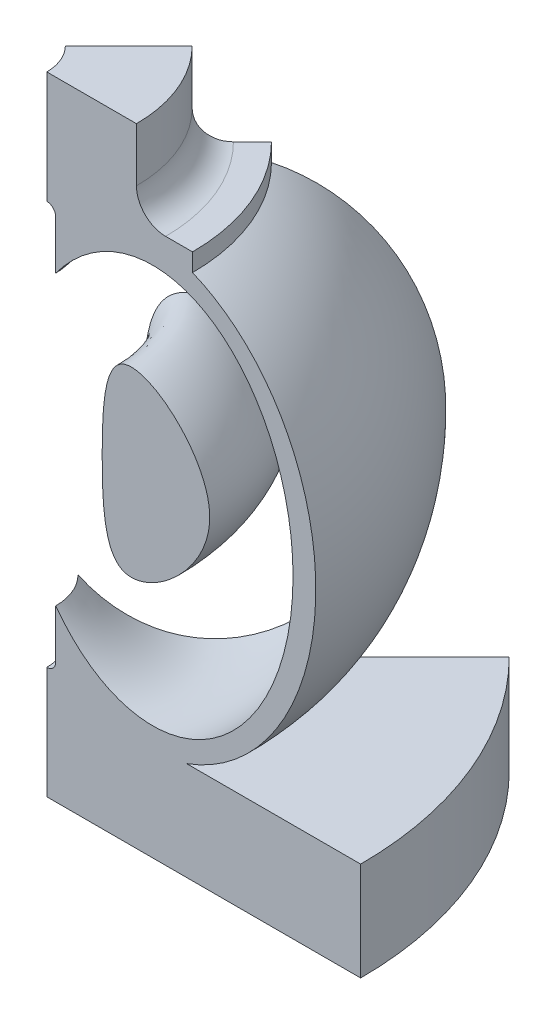
ISO-10303-21;
HEADER;
FILE_DESCRIPTION(('STEP AP214'),'2;1');
FILE_NAME('part.step','',(''),(''),'','','');
FILE_SCHEMA(('AUTOMOTIVE_DESIGN { 1 0 10303 214 1 1 1 1 }'));
ENDSEC;
DATA;
#1=APPLICATION_CONTEXT('core data for automotive mechanical design processes');
#2=APPLICATION_PROTOCOL_DEFINITION('international standard','automotive_design',2000,#1);
#3=PRODUCT_CONTEXT('',#1,'mechanical');
#4=PRODUCT('Part','Part','',(#3));
#5=PRODUCT_RELATED_PRODUCT_CATEGORY('part','',(#4));
#6=PRODUCT_DEFINITION_FORMATION('','',#4);
#7=PRODUCT_DEFINITION_CONTEXT('part definition',#1,'design');
#8=PRODUCT_DEFINITION('design','',#6,#7);
#9=PRODUCT_DEFINITION_SHAPE('','',#8);
#10=(LENGTH_UNIT() NAMED_UNIT(*) SI_UNIT(.MILLI.,.METRE.));
#11=(NAMED_UNIT(*) PLANE_ANGLE_UNIT() SI_UNIT($,.RADIAN.));
#12=(NAMED_UNIT(*) SI_UNIT($,.STERADIAN.) SOLID_ANGLE_UNIT());
#13=UNCERTAINTY_MEASURE_WITH_UNIT(LENGTH_MEASURE(1.E-05),#10,'distance_accuracy_value','');
#14=(GEOMETRIC_REPRESENTATION_CONTEXT(3) GLOBAL_UNCERTAINTY_ASSIGNED_CONTEXT((#13)) GLOBAL_UNIT_ASSIGNED_CONTEXT((#10,
#11,#12)) REPRESENTATION_CONTEXT('',''));
#15=CARTESIAN_POINT('',(0.,0.,0.));
#16=DIRECTION('',(0.,0.,1.));
#17=DIRECTION('',(1.,0.,0.));
#18=AXIS2_PLACEMENT_3D('',#15,#16,#17);
#19=CARTESIAN_POINT('',(7905.38327975833,36060.0850209999,-7905.38327975836));
#20=CARTESIAN_POINT('',(7905.38327975833,31491.9740078896,-7905.38327975836));
#21=CARTESIAN_POINT('',(8201.44165740169,20757.9608409932,-8201.44165740171));
#22=CARTESIAN_POINT('',(21087.6598531945,36060.0850209999,-21087.6598531946));
#23=CARTESIAN_POINT('',(8201.44165740169,51362.2092010066,-8201.44165740171));
#24=CARTESIAN_POINT('',(7905.38327975833,40628.1960341102,-7905.38327975836));
#25=CARTESIAN_POINT('',(7905.38327975833,36060.0850209999,-7905.38327975836));
#26=B_SPLINE_CURVE_WITH_KNOTS('',3,(#19,#20,#21,#22,#23,#24,#25),.UNSPECIFIED.,.T.,.F.,(4,1,1,1,
4),(0.,0.212786724875572,0.5,0.787213275124428,1.),.UNSPECIFIED.);
#27=CARTESIAN_POINT('',(0.,0.,0.));
#28=DIRECTION('',(0.,-1.,0.));
#29=AXIS1_PLACEMENT('',#27,#28);
#30=SURFACE_OF_REVOLUTION('',#26,#29);
#31=CARTESIAN_POINT('',(7905.38327975833,36060.0850209999,-7905.38327975836));
#32=VERTEX_POINT('',#31);
#33=EDGE_CURVE('E11',#32,#32,#26,.T.);
#34=ORIENTED_EDGE('',*,*,#33,.T.);
#35=EDGE_LOOP('',(#34));
#36=FACE_BOUND('',#35,.T.);
#37=CARTESIAN_POINT('',(11179.9002499917,36060.0850209999,0.));
#38=CARTESIAN_POINT('',(11179.9002499917,31491.9740078896,0.));
#39=CARTESIAN_POINT('',(11598.5900229092,20757.9608409932,0.));
#40=CARTESIAN_POINT('',(29822.4545630983,36060.0850209999,0.));
#41=CARTESIAN_POINT('',(11598.5900229092,51362.2092010066,0.));
#42=CARTESIAN_POINT('',(11179.9002499917,40628.1960341102,0.));
#43=CARTESIAN_POINT('',(11179.9002499917,36060.0850209999,0.));
#44=B_SPLINE_CURVE_WITH_KNOTS('',3,(#37,#38,#39,#40,#41,#42,#43),.UNSPECIFIED.,.T.,.F.,(4,1,1,1,
4),(0.,0.212786724875572,0.5,0.787213275124428,1.),.UNSPECIFIED.);
#45=CARTESIAN_POINT('',(11179.9002499917,36060.0850209999,0.));
#46=VERTEX_POINT('',#45);
#47=EDGE_CURVE('E50',#46,#46,#44,.T.);
#48=ORIENTED_EDGE('',*,*,#47,.F.);
#49=EDGE_LOOP('',(#48));
#50=FACE_BOUND('',#49,.T.);
#51=ADVANCED_FACE('F41',(#36,#50),#30,.F.);
#52=CARTESIAN_POINT('',(16386.1475071322,36060.0850209999,-16386.1475071322));
#53=DIRECTION('',(0.707106781186549,0.,0.707106781186546));
#54=DIRECTION('',(0.707106781186546,0.,-0.707106781186549));
#55=AXIS2_PLACEMENT_3D('',#52,#53,#54);
#56=PLANE('',#55);
#57=ORIENTED_EDGE('',*,*,#33,.F.);
#58=EDGE_LOOP('',(#57));
#59=FACE_BOUND('',#58,.T.);
#60=ADVANCED_FACE('F64',(#59),#56,.F.);
#61=CARTESIAN_POINT('',(23173.5120396325,36060.0850209999,0.));
#62=DIRECTION('',(0.,0.,1.));
#63=DIRECTION('',(1.,0.,0.));
#64=AXIS2_PLACEMENT_3D('',#61,#62,#63);
#65=PLANE('',#64);
#66=ORIENTED_EDGE('',*,*,#47,.T.);
#67=EDGE_LOOP('',(#66));
#68=FACE_BOUND('',#67,.T.);
#69=ADVANCED_FACE('F61',(#68),#65,.T.);
#70=CLOSED_SHELL('',(#51,#60,#69));
#71=MANIFOLD_SOLID_BREP('B2',#70);
#72=CARTESIAN_POINT('',(0.,0.,0.));
#73=DIRECTION('',(0.,-1.,0.));
#74=DIRECTION('',(0.,0.,-1.));
#75=AXIS2_PLACEMENT_3D('',#72,#73,#74);
#76=CYLINDRICAL_SURFACE('',#75,6000.);
#77=CARTESIAN_POINT('',(0.,51060.9923501116,0.));
#78=DIRECTION('',(0.,-1.,0.));
#79=DIRECTION('',(0.,0.,-1.));
#80=AXIS2_PLACEMENT_3D('',#77,#78,#79);
#81=CIRCLE('',#80,6000.);
#82=CARTESIAN_POINT('',(5999.99999999999,51060.9923501116,0.));
#83=VERTEX_POINT('',#82);
#84=CARTESIAN_POINT('',(4242.64068711928,51060.9923501116,-4242.64068711929));
#85=VERTEX_POINT('',#84);
#86=EDGE_CURVE('E205',#83,#85,#81,.F.);
#87=ORIENTED_EDGE('',*,*,#86,.F.);
#88=DIRECTION('',(0.,-1.,0.));
#89=VECTOR('',#88,1.);
#90=CARTESIAN_POINT('',(5999.99999999998,56500.,0.));
#91=LINE('',#90,#89);
#92=CARTESIAN_POINT('',(5999.99999999999,56500.,0.));
#93=VERTEX_POINT('',#92);
#94=EDGE_CURVE('E213',#93,#83,#91,.T.);
#95=ORIENTED_EDGE('',*,*,#94,.F.);
#96=CARTESIAN_POINT('',(0.,56500.,0.));
#97=DIRECTION('',(0.,-1.,0.));
#98=DIRECTION('',(0.,0.,-1.));
#99=AXIS2_PLACEMENT_3D('',#96,#97,#98);
#100=CIRCLE('',#99,5999.99999999999);
#101=CARTESIAN_POINT('',(4242.64068711927,56500.,-4242.64068711929));
#102=VERTEX_POINT('',#101);
#103=EDGE_CURVE('E390',#102,#93,#100,.T.);
#104=ORIENTED_EDGE('',*,*,#103,.F.);
#105=DIRECTION('',(0.,-1.,0.));
#106=VECTOR('',#105,1.);
#107=CARTESIAN_POINT('',(4242.64068711926,56500.,-4242.64068711928));
#108=LINE('',#107,#106);
#109=EDGE_CURVE('E215',#102,#85,#108,.T.);
#110=ORIENTED_EDGE('',*,*,#109,.T.);
#111=EDGE_LOOP('',(#87,#95,#104,#110));
#112=FACE_BOUND('',#111,.T.);
#113=ADVANCED_FACE('F93',(#112),#76,.F.);
#114=CARTESIAN_POINT('',(3535.53390593273,70000.,-3535.53390593274));
#115=DIRECTION('',(0.,1.,0.));
#116=DIRECTION('',(0.,0.,1.));
#117=AXIS2_PLACEMENT_3D('',#114,#115,#116);
#118=PLANE('',#117);
#119=CARTESIAN_POINT('',(0.,70000.,0.));
#120=DIRECTION('',(0.,-1.,0.));
#121=DIRECTION('',(0.,0.,-1.));
#122=AXIS2_PLACEMENT_3D('',#119,#120,#121);
#123=CIRCLE('',#122,5000.);
#124=CARTESIAN_POINT('',(3535.53390593273,70000.,-3535.53390593274));
#125=VERTEX_POINT('',#124);
#126=CARTESIAN_POINT('',(5000.,70000.,0.));
#127=VERTEX_POINT('',#126);
#128=EDGE_CURVE('E101',#125,#127,#123,.T.);
#129=ORIENTED_EDGE('',*,*,#128,.T.);
#130=DIRECTION('',(-1.,0.,0.));
#131=VECTOR('',#130,1.);
#132=CARTESIAN_POINT('',(5000.,70000.,0.));
#133=LINE('',#132,#131);
#134=CARTESIAN_POINT('',(15000.,70000.,0.));
#135=VERTEX_POINT('',#134);
#136=EDGE_CURVE('E394',#135,#127,#133,.T.);
#137=ORIENTED_EDGE('',*,*,#136,.F.);
#138=CARTESIAN_POINT('',(0.,70000.,0.));
#139=DIRECTION('',(0.,-1.,0.));
#140=DIRECTION('',(0.,0.,-1.));
#141=AXIS2_PLACEMENT_3D('',#138,#139,#140);
#142=CIRCLE('',#141,15000.);
#143=CARTESIAN_POINT('',(10606.6017177982,70000.,-10606.6017177982));
#144=VERTEX_POINT('',#143);
#145=EDGE_CURVE('E115',#144,#135,#142,.T.);
#146=ORIENTED_EDGE('',*,*,#145,.F.);
#147=DIRECTION('',(-0.707106781186546,0.,0.707106781186549));
#148=VECTOR('',#147,1.);
#149=CARTESIAN_POINT('',(3535.53390593273,70000.,-3535.53390593274));
#150=LINE('',#149,#148);
#151=EDGE_CURVE('E258',#144,#125,#150,.T.);
#152=ORIENTED_EDGE('',*,*,#151,.T.);
#153=EDGE_LOOP('',(#129,#137,#146,#152));
#154=FACE_BOUND('',#153,.T.);
#155=ADVANCED_FACE('F326',(#154),#118,.T.);
#156=CARTESIAN_POINT('',(0.,0.,0.));
#157=DIRECTION('',(0.,-1.,0.));
#158=DIRECTION('',(0.,0.,-1.));
#159=AXIS2_PLACEMENT_3D('',#156,#157,#158);
#160=CYLINDRICAL_SURFACE('',#159,5000.);
#161=CARTESIAN_POINT('',(0.,57500.,0.));
#162=DIRECTION('',(0.,-1.,0.));
#163=DIRECTION('',(0.,0.,-1.));
#164=AXIS2_PLACEMENT_3D('',#161,#162,#163);
#165=CIRCLE('',#164,5000.);
#166=CARTESIAN_POINT('',(3535.53390593273,57500.,-3535.53390593275));
#167=VERTEX_POINT('',#166);
#168=CARTESIAN_POINT('',(5000.,57500.,0.));
#169=VERTEX_POINT('',#168);
#170=EDGE_CURVE('E392',#167,#169,#165,.T.);
#171=ORIENTED_EDGE('',*,*,#170,.T.);
#172=DIRECTION('',(0.,-1.,0.));
#173=VECTOR('',#172,1.);
#174=CARTESIAN_POINT('',(5000.,70000.,0.));
#175=LINE('',#174,#173);
#176=EDGE_CURVE('E397',#127,#169,#175,.T.);
#177=ORIENTED_EDGE('',*,*,#176,.F.);
#178=ORIENTED_EDGE('',*,*,#128,.F.);
#179=DIRECTION('',(0.,-1.,0.));
#180=VECTOR('',#179,1.);
#181=CARTESIAN_POINT('',(3535.53390593273,70000.,-3535.53390593274));
#182=LINE('',#181,#180);
#183=EDGE_CURVE('E260',#125,#167,#182,.T.);
#184=ORIENTED_EDGE('',*,*,#183,.T.);
#185=EDGE_LOOP('',(#171,#177,#178,#184));
#186=FACE_BOUND('',#185,.T.);
#187=ADVANCED_FACE('F95',(#186),#160,.F.);
#188=CARTESIAN_POINT('',(0.,56500.,0.));
#189=DIRECTION('',(0.,-1.,0.));
#190=DIRECTION('',(0.,0.,-1.));
#191=AXIS2_PLACEMENT_3D('',#188,#189,#190);
#192=TOROIDAL_SURFACE('',#191,5000.,999.999999999991);
#193=ORIENTED_EDGE('',*,*,#103,.T.);
#194=CARTESIAN_POINT('',(5000.,56500.,0.));
#195=DIRECTION('',(0.,0.,-1.));
#196=DIRECTION('',(-1.,0.,0.));
#197=AXIS2_PLACEMENT_3D('',#194,#195,#196);
#198=CIRCLE('',#197,999.999999999991);
#199=EDGE_CURVE('E222',#169,#93,#198,.T.);
#200=ORIENTED_EDGE('',*,*,#199,.F.);
#201=ORIENTED_EDGE('',*,*,#170,.F.);
#202=CARTESIAN_POINT('',(3535.53390593273,56500.,-3535.53390593274));
#203=DIRECTION('',(-0.707106781186549,0.,-0.707106781186546));
#204=DIRECTION('',(-0.707106781186546,0.,0.707106781186549));
#205=AXIS2_PLACEMENT_3D('',#202,#203,#204);
#206=CIRCLE('',#205,999.999999999991);
#207=EDGE_CURVE('E263',#167,#102,#206,.T.);
#208=ORIENTED_EDGE('',*,*,#207,.T.);
#209=EDGE_LOOP('',(#193,#200,#201,#208));
#210=FACE_BOUND('',#209,.T.);
#211=ADVANCED_FACE('F319',(#210),#192,.F.);
#212=CARTESIAN_POINT('',(0.,18939.0076498884,0.));
#213=DIRECTION('',(0.,-1.,0.));
#214=DIRECTION('',(0.,0.,-1.));
#215=AXIS2_PLACEMENT_3D('',#212,#213,#214);
#216=CIRCLE('',#215,6000.);
#217=CARTESIAN_POINT('',(4242.64068711928,18939.0076498884,-4242.64068711929));
#218=VERTEX_POINT('',#217);
#219=CARTESIAN_POINT('',(6000.,18939.0076498884,0.));
#220=VERTEX_POINT('',#219);
#221=EDGE_CURVE('E107',#218,#220,#216,.T.);
#222=ORIENTED_EDGE('',*,*,#221,.F.);
#223=CARTESIAN_POINT('',(4242.64068711928,13500.,-4242.6406871193));
#224=VERTEX_POINT('',#223);
#225=EDGE_CURVE('E266',#218,#224,#108,.T.);
#226=ORIENTED_EDGE('',*,*,#225,.T.);
#227=CARTESIAN_POINT('',(0.,13500.,0.));
#228=DIRECTION('',(0.,-1.,0.));
#229=DIRECTION('',(0.,0.,-1.));
#230=AXIS2_PLACEMENT_3D('',#227,#228,#229);
#231=CIRCLE('',#230,6000.00000000001);
#232=CARTESIAN_POINT('',(6000.00000000001,13500.,0.));
#233=VERTEX_POINT('',#232);
#234=EDGE_CURVE('E387',#224,#233,#231,.T.);
#235=ORIENTED_EDGE('',*,*,#234,.T.);
#236=EDGE_CURVE('E224',#220,#233,#91,.T.);
#237=ORIENTED_EDGE('',*,*,#236,.F.);
#238=EDGE_LOOP('',(#222,#226,#235,#237));
#239=FACE_BOUND('',#238,.T.);
#240=ADVANCED_FACE('F316',(#239),#76,.F.);
#241=CARTESIAN_POINT('',(0.,13500.,0.));
#242=DIRECTION('',(0.,-1.,0.));
#243=DIRECTION('',(0.,0.,-1.));
#244=AXIS2_PLACEMENT_3D('',#241,#242,#243);
#245=TOROIDAL_SURFACE('',#244,5000.,1000.00000000001);
#246=CARTESIAN_POINT('',(0.,12500.,0.));
#247=DIRECTION('',(0.,-1.,0.));
#248=DIRECTION('',(0.,0.,-1.));
#249=AXIS2_PLACEMENT_3D('',#246,#247,#248);
#250=CIRCLE('',#249,5000.);
#251=CARTESIAN_POINT('',(3535.53390593273,12500.,-3535.53390593275));
#252=VERTEX_POINT('',#251);
#253=CARTESIAN_POINT('',(5000.,12500.,0.));
#254=VERTEX_POINT('',#253);
#255=EDGE_CURVE('E385',#252,#254,#250,.T.);
#256=ORIENTED_EDGE('',*,*,#255,.T.);
#257=CARTESIAN_POINT('',(5000.,13500.,0.));
#258=DIRECTION('',(0.,0.,-1.));
#259=DIRECTION('',(1.,0.,0.));
#260=AXIS2_PLACEMENT_3D('',#257,#258,#259);
#261=CIRCLE('',#260,1000.00000000001);
#262=EDGE_CURVE('E223',#233,#254,#261,.T.);
#263=ORIENTED_EDGE('',*,*,#262,.F.);
#264=ORIENTED_EDGE('',*,*,#234,.F.);
#265=CARTESIAN_POINT('',(3535.53390593273,13500.,-3535.53390593274));
#266=DIRECTION('',(-0.707106781186549,0.,-0.707106781186546));
#267=DIRECTION('',(0.707106781186546,0.,-0.707106781186549));
#268=AXIS2_PLACEMENT_3D('',#265,#266,#267);
#269=CIRCLE('',#268,1000.00000000001);
#270=EDGE_CURVE('E268',#224,#252,#269,.T.);
#271=ORIENTED_EDGE('',*,*,#270,.T.);
#272=EDGE_LOOP('',(#256,#263,#264,#271));
#273=FACE_BOUND('',#272,.T.);
#274=ADVANCED_FACE('F312',(#273),#245,.F.);
#275=CARTESIAN_POINT('',(0.,0.,0.));
#276=DIRECTION('',(0.,-1.,0.));
#277=DIRECTION('',(0.,0.,-1.));
#278=AXIS2_PLACEMENT_3D('',#275,#276,#277);
#279=CYLINDRICAL_SURFACE('',#278,5000.);
#280=CARTESIAN_POINT('',(0.,0.,0.));
#281=DIRECTION('',(0.,-1.,0.));
#282=DIRECTION('',(0.,0.,-1.));
#283=AXIS2_PLACEMENT_3D('',#280,#281,#282);
#284=CIRCLE('',#283,5000.);
#285=CARTESIAN_POINT('',(3535.53390593273,0.,-3535.53390593274));
#286=VERTEX_POINT('',#285);
#287=CARTESIAN_POINT('',(5000.,0.,0.));
#288=VERTEX_POINT('',#287);
#289=EDGE_CURVE('E383',#286,#288,#284,.T.);
#290=ORIENTED_EDGE('',*,*,#289,.T.);
#291=DIRECTION('',(0.,-1.,0.));
#292=VECTOR('',#291,1.);
#293=CARTESIAN_POINT('',(5000.,0.,0.));
#294=LINE('',#293,#292);
#295=EDGE_CURVE('E227',#254,#288,#294,.T.);
#296=ORIENTED_EDGE('',*,*,#295,.F.);
#297=ORIENTED_EDGE('',*,*,#255,.F.);
#298=DIRECTION('',(0.,-1.,0.));
#299=VECTOR('',#298,1.);
#300=CARTESIAN_POINT('',(3535.53390593273,0.,-3535.53390593274));
#301=LINE('',#300,#299);
#302=EDGE_CURVE('E271',#252,#286,#301,.T.);
#303=ORIENTED_EDGE('',*,*,#302,.T.);
#304=EDGE_LOOP('',(#290,#296,#297,#303));
#305=FACE_BOUND('',#304,.T.);
#306=ADVANCED_FACE('F308',(#305),#279,.F.);
#307=CARTESIAN_POINT('',(28284.2712474619,2.1094237467878E-12,-28284.271247462));
#308=DIRECTION('',(0.,-1.,0.));
#309=DIRECTION('',(0.,0.,-1.));
#310=AXIS2_PLACEMENT_3D('',#307,#308,#309);
#311=PLANE('',#310);
#312=CARTESIAN_POINT('',(0.,4.21884749357559E-12,0.));
#313=DIRECTION('',(0.,-1.,0.));
#314=DIRECTION('',(0.,0.,-1.));
#315=AXIS2_PLACEMENT_3D('',#312,#313,#314);
#316=CIRCLE('',#315,40000.);
#317=CARTESIAN_POINT('',(28284.2712474619,4.21884749357559E-12,-28284.271247462));
#318=VERTEX_POINT('',#317);
#319=CARTESIAN_POINT('',(40000.,4.21884749357559E-12,0.));
#320=VERTEX_POINT('',#319);
#321=EDGE_CURVE('E381',#318,#320,#316,.T.);
#322=ORIENTED_EDGE('',*,*,#321,.T.);
#323=DIRECTION('',(1.,0.,0.));
#324=VECTOR('',#323,1.);
#325=CARTESIAN_POINT('',(40000.,4.21884749357559E-12,0.));
#326=LINE('',#325,#324);
#327=EDGE_CURVE('E234',#288,#320,#326,.T.);
#328=ORIENTED_EDGE('',*,*,#327,.F.);
#329=ORIENTED_EDGE('',*,*,#289,.F.);
#330=DIRECTION('',(0.707106781186546,0.,-0.707106781186549));
#331=VECTOR('',#330,1.);
#332=CARTESIAN_POINT('',(28284.2712474619,4.21884749357559E-12,-28284.271247462));
#333=LINE('',#332,#331);
#334=EDGE_CURVE('E274',#286,#318,#333,.T.);
#335=ORIENTED_EDGE('',*,*,#334,.T.);
#336=EDGE_LOOP('',(#322,#328,#329,#335));
#337=FACE_BOUND('',#336,.T.);
#338=ADVANCED_FACE('F304',(#337),#311,.T.);
#339=CARTESIAN_POINT('',(0.,0.,0.));
#340=DIRECTION('',(0.,-1.,0.));
#341=DIRECTION('',(0.,0.,-1.));
#342=AXIS2_PLACEMENT_3D('',#339,#340,#341);
#343=CYLINDRICAL_SURFACE('',#342,40000.);
#344=CARTESIAN_POINT('',(0.,11000.,0.));
#345=DIRECTION('',(0.,-1.,0.));
#346=DIRECTION('',(0.,0.,-1.));
#347=AXIS2_PLACEMENT_3D('',#344,#345,#346);
#348=CIRCLE('',#347,40000.);
#349=CARTESIAN_POINT('',(28284.2712474619,11000.,-28284.271247462));
#350=VERTEX_POINT('',#349);
#351=CARTESIAN_POINT('',(40000.,11000.,0.));
#352=VERTEX_POINT('',#351);
#353=EDGE_CURVE('E379',#350,#352,#348,.T.);
#354=ORIENTED_EDGE('',*,*,#353,.T.);
#355=DIRECTION('',(0.,1.,0.));
#356=VECTOR('',#355,1.);
#357=CARTESIAN_POINT('',(40000.,11000.,0.));
#358=LINE('',#357,#356);
#359=EDGE_CURVE('E237',#320,#352,#358,.T.);
#360=ORIENTED_EDGE('',*,*,#359,.F.);
#361=ORIENTED_EDGE('',*,*,#321,.F.);
#362=DIRECTION('',(0.,1.,0.));
#363=VECTOR('',#362,1.);
#364=CARTESIAN_POINT('',(28284.2712474619,11000.,-28284.271247462));
#365=LINE('',#364,#363);
#366=EDGE_CURVE('E277',#318,#350,#365,.T.);
#367=ORIENTED_EDGE('',*,*,#366,.T.);
#368=EDGE_LOOP('',(#354,#360,#361,#367));
#369=FACE_BOUND('',#368,.T.);
#370=ADVANCED_FACE('F300',(#369),#343,.T.);
#371=CARTESIAN_POINT('',(28284.2712474619,11000.,-28284.271247462));
#372=DIRECTION('',(0.,1.,0.));
#373=DIRECTION('',(0.,0.,1.));
#374=AXIS2_PLACEMENT_3D('',#371,#372,#373);
#375=PLANE('',#374);
#376=CARTESIAN_POINT('',(0.,11000.,0.));
#377=DIRECTION('',(0.,-1.,0.));
#378=DIRECTION('',(0.,0.,-1.));
#379=AXIS2_PLACEMENT_3D('',#376,#377,#378);
#380=CIRCLE('',#379,20600.);
#381=CARTESIAN_POINT('',(14566.3996924429,11000.,-14566.3996924429));
#382=VERTEX_POINT('',#381);
#383=CARTESIAN_POINT('',(20600.,11000.,0.));
#384=VERTEX_POINT('',#383);
#385=EDGE_CURVE('E377',#382,#384,#380,.T.);
#386=ORIENTED_EDGE('',*,*,#385,.T.);
#387=DIRECTION('',(-1.,0.,0.));
#388=VECTOR('',#387,1.);
#389=CARTESIAN_POINT('',(40000.,11000.,0.));
#390=LINE('',#389,#388);
#391=EDGE_CURVE('E240',#352,#384,#390,.T.);
#392=ORIENTED_EDGE('',*,*,#391,.F.);
#393=ORIENTED_EDGE('',*,*,#353,.F.);
#394=DIRECTION('',(-0.707106781186546,0.,0.707106781186549));
#395=VECTOR('',#394,1.);
#396=CARTESIAN_POINT('',(28284.2712474619,11000.,-28284.271247462));
#397=LINE('',#396,#395);
#398=EDGE_CURVE('E280',#350,#382,#397,.T.);
#399=ORIENTED_EDGE('',*,*,#398,.T.);
#400=EDGE_LOOP('',(#386,#392,#393,#399));
#401=FACE_BOUND('',#400,.T.);
#402=ADVANCED_FACE('F295',(#401),#375,.T.);
#403=CARTESIAN_POINT('',(10606.6017177982,35000.,-10606.6017177982));
#404=DIRECTION('',(0.707106781186549,0.,0.707106781186546));
#405=DIRECTION('',(0.,1.,0.));
#406=AXIS2_PLACEMENT_3D('',#403,#404,#405);
#407=ELLIPSE('',#406,25000.,20000.);
#408=TRIMMED_CURVE('',#407,(PARAMETER_VALUE(2.29353057460831)),
(PARAMETER_VALUE(7.13124738616107)),.T.,.PARAMETER.);
#409=CARTESIAN_POINT('',(0.,0.,0.));
#410=DIRECTION('',(0.,-1.,0.));
#411=AXIS1_PLACEMENT('',#409,#410);
#412=SURFACE_OF_REVOLUTION('',#408,#411);
#413=CARTESIAN_POINT('',(0.,58746.5072621946,0.));
#414=DIRECTION('',(0.,-1.,0.));
#415=DIRECTION('',(0.,0.,-1.));
#416=AXIS2_PLACEMENT_3D('',#413,#414,#415);
#417=CIRCLE('',#416,21253.4927378054);
#418=CARTESIAN_POINT('',(15028.4888388012,58746.5072621946,-15028.4888388012));
#419=VERTEX_POINT('',#418);
#420=CARTESIAN_POINT('',(21253.4927378054,58746.5072621946,0.));
#421=VERTEX_POINT('',#420);
#422=EDGE_CURVE('E375',#419,#421,#417,.T.);
#423=ORIENTED_EDGE('',*,*,#422,.T.);
#424=CARTESIAN_POINT('',(15000.,35000.,0.));
#425=DIRECTION('',(0.,0.,1.));
#426=DIRECTION('',(0.,1.,0.));
#427=AXIS2_PLACEMENT_3D('',#424,#425,#426);
#428=ELLIPSE('',#427,25000.,20000.);
#429=EDGE_CURVE('E243',#384,#421,#428,.T.);
#430=ORIENTED_EDGE('',*,*,#429,.F.);
#431=ORIENTED_EDGE('',*,*,#385,.F.);
#432=EDGE_CURVE('E283',#382,#419,#407,.T.);
#433=ORIENTED_EDGE('',*,*,#432,.T.);
#434=EDGE_LOOP('',(#423,#430,#431,#433));
#435=FACE_BOUND('',#434,.T.);
#436=ADVANCED_FACE('F290',(#435),#412,.F.);
#437=CARTESIAN_POINT('',(0.,0.,0.));
#438=DIRECTION('',(0.,-1.,0.));
#439=DIRECTION('',(0.,0.,-1.));
#440=AXIS2_PLACEMENT_3D('',#437,#438,#439);
#441=CYLINDRICAL_SURFACE('',#440,21253.4927378054);
#442=CARTESIAN_POINT('',(0.,60746.5072621946,0.));
#443=DIRECTION('',(0.,-1.,0.));
#444=DIRECTION('',(0.,0.,-1.));
#445=AXIS2_PLACEMENT_3D('',#442,#443,#444);
#446=CIRCLE('',#445,21253.4927378054);
#447=CARTESIAN_POINT('',(15028.4888388012,60746.5072621946,-15028.4888388012));
#448=VERTEX_POINT('',#447);
#449=CARTESIAN_POINT('',(21253.4927378054,60746.5072621946,0.));
#450=VERTEX_POINT('',#449);
#451=EDGE_CURVE('E361',#448,#450,#446,.T.);
#452=ORIENTED_EDGE('',*,*,#451,.T.);
#453=DIRECTION('',(0.,1.,0.));
#454=VECTOR('',#453,1.);
#455=CARTESIAN_POINT('',(21253.4927378054,60746.5072621946,0.));
#456=LINE('',#455,#454);
#457=EDGE_CURVE('E246',#421,#450,#456,.T.);
#458=ORIENTED_EDGE('',*,*,#457,.F.);
#459=ORIENTED_EDGE('',*,*,#422,.F.);
#460=DIRECTION('',(0.,1.,0.));
#461=VECTOR('',#460,1.);
#462=CARTESIAN_POINT('',(15028.4888388012,60746.5072621946,-15028.4888388012));
#463=LINE('',#462,#461);
#464=EDGE_CURVE('E287',#419,#448,#463,.T.);
#465=ORIENTED_EDGE('',*,*,#464,.T.);
#466=EDGE_LOOP('',(#452,#458,#459,#465));
#467=FACE_BOUND('',#466,.T.);
#468=ADVANCED_FACE('F294',(#467),#441,.T.);
#469=CARTESIAN_POINT('',(12907.1684952415,60746.5072621946,-12907.1684952416));
#470=DIRECTION('',(0.,1.,0.));
#471=DIRECTION('',(0.,0.,1.));
#472=AXIS2_PLACEMENT_3D('',#469,#470,#471);
#473=PLANE('',#472);
#474=CARTESIAN_POINT('',(0.,60746.5072621946,0.));
#475=DIRECTION('',(0.,-1.,0.));
#476=DIRECTION('',(0.,0.,-1.));
#477=AXIS2_PLACEMENT_3D('',#474,#475,#476);
#478=CIRCLE('',#477,18253.4927378054);
#479=CARTESIAN_POINT('',(12907.1684952415,60746.5072621946,-12907.1684952416));
#480=VERTEX_POINT('',#479);
#481=CARTESIAN_POINT('',(18253.4927378054,60746.5072621946,0.));
#482=VERTEX_POINT('',#481);
#483=EDGE_CURVE('E355',#480,#482,#478,.T.);
#484=ORIENTED_EDGE('',*,*,#483,.T.);
#485=DIRECTION('',(-1.,0.,0.));
#486=VECTOR('',#485,1.);
#487=CARTESIAN_POINT('',(18253.4927378054,60746.5072621946,0.));
#488=LINE('',#487,#486);
#489=EDGE_CURVE('E249',#450,#482,#488,.T.);
#490=ORIENTED_EDGE('',*,*,#489,.F.);
#491=ORIENTED_EDGE('',*,*,#451,.F.);
#492=DIRECTION('',(-0.707106781186546,0.,0.707106781186549));
#493=VECTOR('',#492,1.);
#494=CARTESIAN_POINT('',(12907.1684952415,60746.5072621946,-12907.1684952416));
#495=LINE('',#494,#493);
#496=EDGE_CURVE('E357',#448,#480,#495,.T.);
#497=ORIENTED_EDGE('',*,*,#496,.T.);
#498=EDGE_LOOP('',(#484,#490,#491,#497));
#499=FACE_BOUND('',#498,.T.);
#500=ADVANCED_FACE('F345',(#499),#473,.T.);
#501=CARTESIAN_POINT('',(0.,64000.,0.));
#502=DIRECTION('',(0.,-1.,0.));
#503=DIRECTION('',(0.,0.,-1.));
#504=AXIS2_PLACEMENT_3D('',#501,#502,#503);
#505=TOROIDAL_SURFACE('',#504,18253.4927378054,3253.49273780536);
#506=CARTESIAN_POINT('',(0.,64000.,0.));
#507=DIRECTION('',(0.,-1.,0.));
#508=DIRECTION('',(0.,0.,-1.));
#509=AXIS2_PLACEMENT_3D('',#506,#507,#508);
#510=CIRCLE('',#509,15000.);
#511=CARTESIAN_POINT('',(10606.6017177982,64000.,-10606.6017177982));
#512=VERTEX_POINT('',#511);
#513=CARTESIAN_POINT('',(15000.,64000.,0.));
#514=VERTEX_POINT('',#513);
#515=EDGE_CURVE('E362',#512,#514,#510,.T.);
#516=ORIENTED_EDGE('',*,*,#515,.T.);
#517=CARTESIAN_POINT('',(18253.4927378054,64000.,0.));
#518=DIRECTION('',(0.,0.,-1.));
#519=DIRECTION('',(1.,0.,0.));
#520=AXIS2_PLACEMENT_3D('',#517,#518,#519);
#521=CIRCLE('',#520,3253.49273780536);
#522=EDGE_CURVE('E252',#482,#514,#521,.T.);
#523=ORIENTED_EDGE('',*,*,#522,.F.);
#524=ORIENTED_EDGE('',*,*,#483,.F.);
#525=CARTESIAN_POINT('',(12907.1684952415,64000.,-12907.1684952416));
#526=DIRECTION('',(-0.707106781186549,0.,-0.707106781186546));
#527=DIRECTION('',(0.707106781186546,0.,-0.707106781186549));
#528=AXIS2_PLACEMENT_3D('',#525,#526,#527);
#529=CIRCLE('',#528,3253.49273780536);
#530=EDGE_CURVE('E366',#480,#512,#529,.T.);
#531=ORIENTED_EDGE('',*,*,#530,.T.);
#532=EDGE_LOOP('',(#516,#523,#524,#531));
#533=FACE_BOUND('',#532,.T.);
#534=ADVANCED_FACE('F342',(#533),#505,.F.);
#535=CARTESIAN_POINT('',(0.,0.,0.));
#536=DIRECTION('',(0.,-1.,0.));
#537=DIRECTION('',(0.,0.,-1.));
#538=AXIS2_PLACEMENT_3D('',#535,#536,#537);
#539=CYLINDRICAL_SURFACE('',#538,15000.);
#540=DIRECTION('',(0.,1.,0.));
#541=VECTOR('',#540,1.);
#542=CARTESIAN_POINT('',(10606.6017177982,70000.,-10606.6017177982));
#543=LINE('',#542,#541);
#544=EDGE_CURVE('E370',#512,#144,#543,.T.);
#545=ORIENTED_EDGE('',*,*,#544,.T.);
#546=ORIENTED_EDGE('',*,*,#145,.T.);
#547=DIRECTION('',(0.,1.,0.));
#548=VECTOR('',#547,1.);
#549=CARTESIAN_POINT('',(15000.,70000.,0.));
#550=LINE('',#549,#548);
#551=EDGE_CURVE('E255',#514,#135,#550,.T.);
#552=ORIENTED_EDGE('',*,*,#551,.F.);
#553=ORIENTED_EDGE('',*,*,#515,.F.);
#554=EDGE_LOOP('',(#545,#546,#552,#553));
#555=FACE_BOUND('',#554,.T.);
#556=ADVANCED_FACE('F339',(#555),#539,.T.);
#557=CARTESIAN_POINT('',(10606.6017177982,35000.,-10606.6017177982));
#558=DIRECTION('',(0.707106781186549,0.,0.707106781186546));
#559=DIRECTION('',(0.707106781186546,0.,-0.707106781186549));
#560=AXIS2_PLACEMENT_3D('',#557,#558,#559);
#561=PLANE('',#560);
#562=ORIENTED_EDGE('',*,*,#225,.F.);
#563=CARTESIAN_POINT('',(11893.9780303648,35000.,-11893.9780303649));
#564=DIRECTION('',(0.707106781186549,0.,0.707106781186546));
#565=DIRECTION('',(0.,-1.,0.));
#566=AXIS2_PLACEMENT_3D('',#563,#564,#565);
#567=ELLIPSE('',#566,22243.3202729126,15640.5531323735);
#568=EDGE_CURVE('E216',#218,#85,#567,.T.);
#569=ORIENTED_EDGE('',*,*,#568,.T.);
#570=ORIENTED_EDGE('',*,*,#109,.F.);
#571=ORIENTED_EDGE('',*,*,#207,.F.);
#572=ORIENTED_EDGE('',*,*,#183,.F.);
#573=ORIENTED_EDGE('',*,*,#151,.F.);
#574=ORIENTED_EDGE('',*,*,#544,.F.);
#575=ORIENTED_EDGE('',*,*,#530,.F.);
#576=ORIENTED_EDGE('',*,*,#496,.F.);
#577=ORIENTED_EDGE('',*,*,#464,.F.);
#578=ORIENTED_EDGE('',*,*,#432,.F.);
#579=ORIENTED_EDGE('',*,*,#398,.F.);
#580=ORIENTED_EDGE('',*,*,#366,.F.);
#581=ORIENTED_EDGE('',*,*,#334,.F.);
#582=ORIENTED_EDGE('',*,*,#302,.F.);
#583=ORIENTED_EDGE('',*,*,#270,.F.);
#584=EDGE_LOOP('',(#562,#569,#570,#571,#572,#573,#574,#575,#576,#577,#578,#579,#580,#581,#582,#583));
#585=FACE_BOUND('',#584,.T.);
#586=ADVANCED_FACE('F337',(#585),#561,.F.);
#587=CARTESIAN_POINT('',(15000.,35000.,0.));
#588=DIRECTION('',(0.,0.,1.));
#589=DIRECTION('',(1.,0.,0.));
#590=AXIS2_PLACEMENT_3D('',#587,#588,#589);
#591=PLANE('',#590);
#592=CARTESIAN_POINT('',(16820.6250411096,35000.,0.));
#593=DIRECTION('',(0.,0.,1.));
#594=DIRECTION('',(0.,-1.,0.));
#595=AXIS2_PLACEMENT_3D('',#592,#593,#594);
#596=ELLIPSE('',#595,22243.3202729126,15640.5531323735);
#597=EDGE_CURVE('E39',#220,#83,#596,.T.);
#598=ORIENTED_EDGE('',*,*,#597,.F.);
#599=ORIENTED_EDGE('',*,*,#236,.T.);
#600=ORIENTED_EDGE('',*,*,#262,.T.);
#601=ORIENTED_EDGE('',*,*,#295,.T.);
#602=ORIENTED_EDGE('',*,*,#327,.T.);
#603=ORIENTED_EDGE('',*,*,#359,.T.);
#604=ORIENTED_EDGE('',*,*,#391,.T.);
#605=ORIENTED_EDGE('',*,*,#429,.T.);
#606=ORIENTED_EDGE('',*,*,#457,.T.);
#607=ORIENTED_EDGE('',*,*,#489,.T.);
#608=ORIENTED_EDGE('',*,*,#522,.T.);
#609=ORIENTED_EDGE('',*,*,#551,.T.);
#610=ORIENTED_EDGE('',*,*,#136,.T.);
#611=ORIENTED_EDGE('',*,*,#176,.T.);
#612=ORIENTED_EDGE('',*,*,#199,.T.);
#613=ORIENTED_EDGE('',*,*,#94,.T.);
#614=EDGE_LOOP('',(#598,#599,#600,#601,#602,#603,#604,#605,#606,#607,#608,#609,#610,#611,#612,#613));
#615=FACE_BOUND('',#614,.T.);
#616=ADVANCED_FACE('F219',(#615),#591,.T.);
#617=CARTESIAN_POINT('',(16820.6250411096,35000.,0.));
#618=DIRECTION('',(0.,0.,1.));
#619=DIRECTION('',(0.,-1.,0.));
#620=AXIS2_PLACEMENT_3D('',#617,#618,#619);
#621=ELLIPSE('',#620,22243.3202729126,15640.5531323735);
#622=CARTESIAN_POINT('',(0.,0.,0.));
#623=DIRECTION('',(0.,-1.,0.));
#624=AXIS1_PLACEMENT('',#622,#623);
#625=SURFACE_OF_REVOLUTION('',#621,#624);
#626=ORIENTED_EDGE('',*,*,#221,.T.);
#627=ORIENTED_EDGE('',*,*,#597,.T.);
#628=ORIENTED_EDGE('',*,*,#86,.T.);
#629=ORIENTED_EDGE('',*,*,#568,.F.);
#630=EDGE_LOOP('',(#626,#627,#628,#629));
#631=FACE_BOUND('',#630,.T.);
#632=ADVANCED_FACE('F204',(#631),#625,.T.);
#633=CLOSED_SHELL('',(#113,#155,#187,#211,#240,#274,#306,#338,#370,#402,#436,#468,#500,#534,
#556,#586,#616,#632));
#634=MANIFOLD_SOLID_BREP('B6',#633);
#635=ADVANCED_BREP_SHAPE_REPRESENTATION('',(#18,#71,#634),#14);
#636=SHAPE_DEFINITION_REPRESENTATION(#9,#635);
ENDSEC;
END-ISO-10303-21;
